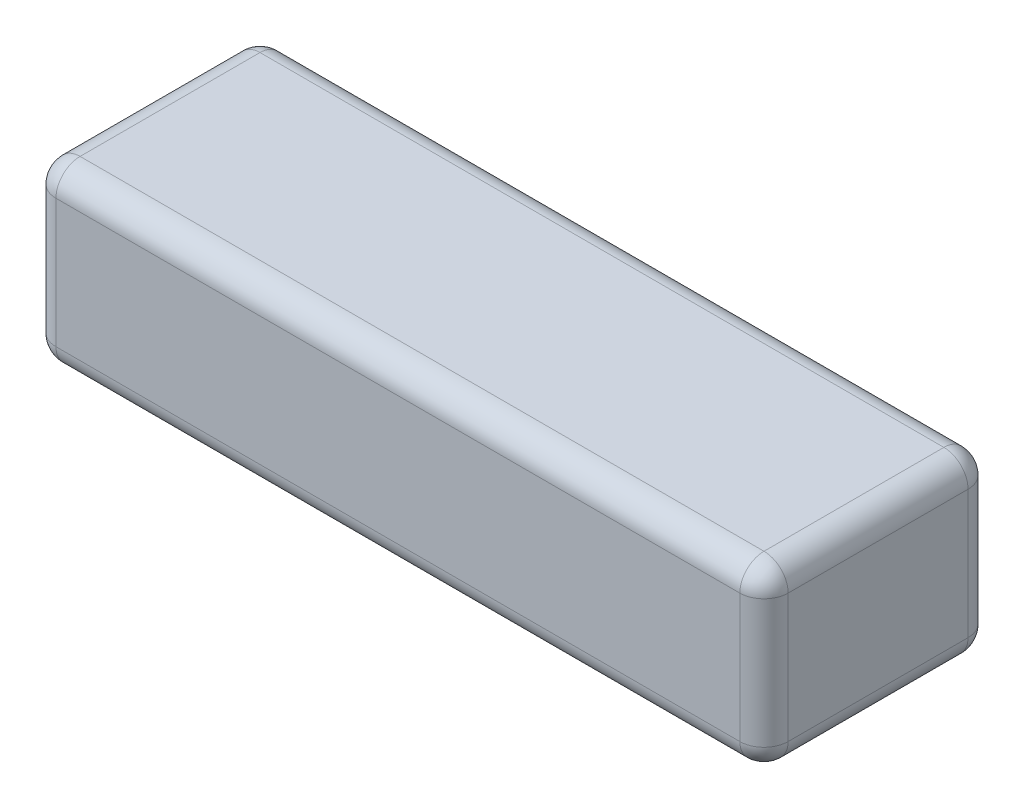
ISO-10303-21;
HEADER;
FILE_DESCRIPTION(('STEP AP214'),'2;1');
FILE_NAME('part.step','',(''),(''),'','','');
FILE_SCHEMA(('AUTOMOTIVE_DESIGN { 1 0 10303 214 1 1 1 1 }'));
ENDSEC;
DATA;
#1=APPLICATION_CONTEXT('core data for automotive mechanical design processes');
#2=APPLICATION_PROTOCOL_DEFINITION('international standard','automotive_design',2000,#1);
#3=PRODUCT_CONTEXT('',#1,'mechanical');
#4=PRODUCT('Part','Part','',(#3));
#5=PRODUCT_RELATED_PRODUCT_CATEGORY('part','',(#4));
#6=PRODUCT_DEFINITION_FORMATION('','',#4);
#7=PRODUCT_DEFINITION_CONTEXT('part definition',#1,'design');
#8=PRODUCT_DEFINITION('design','',#6,#7);
#9=PRODUCT_DEFINITION_SHAPE('','',#8);
#10=(LENGTH_UNIT() NAMED_UNIT(*) SI_UNIT(.MILLI.,.METRE.));
#11=(NAMED_UNIT(*) PLANE_ANGLE_UNIT() SI_UNIT($,.RADIAN.));
#12=(NAMED_UNIT(*) SI_UNIT($,.STERADIAN.) SOLID_ANGLE_UNIT());
#13=UNCERTAINTY_MEASURE_WITH_UNIT(LENGTH_MEASURE(1.E-05),#10,'distance_accuracy_value','');
#14=(GEOMETRIC_REPRESENTATION_CONTEXT(3) GLOBAL_UNCERTAINTY_ASSIGNED_CONTEXT((#13)) GLOBAL_UNIT_ASSIGNED_CONTEXT((#10,
#11,#12)) REPRESENTATION_CONTEXT('',''));
#15=CARTESIAN_POINT('',(0.,0.,0.));
#16=DIRECTION('',(0.,0.,1.));
#17=DIRECTION('',(1.,0.,0.));
#18=AXIS2_PLACEMENT_3D('',#15,#16,#17);
#19=CARTESIAN_POINT('',(77.,37.2,-24.));
#20=DIRECTION('',(-1.,0.,0.));
#21=DIRECTION('',(0.,0.,1.));
#22=AXIS2_PLACEMENT_3D('',#19,#20,#21);
#23=PLANE('',#22);
#24=DIRECTION('',(0.,-1.,0.));
#25=VECTOR('',#24,1.);
#26=CARTESIAN_POINT('',(77.,37.2,18.92));
#27=LINE('',#26,#25);
#28=CARTESIAN_POINT('',(77.,32.12,18.92));
#29=VERTEX_POINT('',#28);
#30=CARTESIAN_POINT('',(77.,5.08,18.92));
#31=VERTEX_POINT('',#30);
#32=EDGE_CURVE('E191',#29,#31,#27,.T.);
#33=ORIENTED_EDGE('',*,*,#32,.T.);
#34=DIRECTION('',(0.,0.,-1.));
#35=VECTOR('',#34,1.);
#36=CARTESIAN_POINT('',(77.,5.08,-24.));
#37=LINE('',#36,#35);
#38=CARTESIAN_POINT('',(77.,5.08,-18.92));
#39=VERTEX_POINT('',#38);
#40=EDGE_CURVE('E194',#31,#39,#37,.T.);
#41=ORIENTED_EDGE('',*,*,#40,.T.);
#42=DIRECTION('',(0.,-1.,0.));
#43=VECTOR('',#42,1.);
#44=CARTESIAN_POINT('',(77.,37.2,-18.92));
#45=LINE('',#44,#43);
#46=CARTESIAN_POINT('',(77.,32.12,-18.92));
#47=VERTEX_POINT('',#46);
#48=EDGE_CURVE('E189',#39,#47,#45,.F.);
#49=ORIENTED_EDGE('',*,*,#48,.T.);
#50=DIRECTION('',(0.,0.,-1.));
#51=VECTOR('',#50,1.);
#52=CARTESIAN_POINT('',(77.,32.12,24.));
#53=LINE('',#52,#51);
#54=EDGE_CURVE('E187',#47,#29,#53,.F.);
#55=ORIENTED_EDGE('',*,*,#54,.T.);
#56=EDGE_LOOP('',(#33,#41,#49,#55));
#57=FACE_BOUND('',#56,.T.);
#58=ADVANCED_FACE('F40',(#57),#23,.F.);
#59=CARTESIAN_POINT('',(-77.,37.2,-24.));
#60=DIRECTION('',(0.,0.,1.));
#61=DIRECTION('',(1.,0.,0.));
#62=AXIS2_PLACEMENT_3D('',#59,#60,#61);
#63=PLANE('',#62);
#64=DIRECTION('',(0.,-1.,0.));
#65=VECTOR('',#64,1.);
#66=CARTESIAN_POINT('',(71.92,37.2,-24.));
#67=LINE('',#66,#65);
#68=CARTESIAN_POINT('',(71.92,32.12,-24.));
#69=VERTEX_POINT('',#68);
#70=CARTESIAN_POINT('',(71.92,5.08,-24.));
#71=VERTEX_POINT('',#70);
#72=EDGE_CURVE('E173',#69,#71,#67,.T.);
#73=ORIENTED_EDGE('',*,*,#72,.T.);
#74=DIRECTION('',(-1.,0.,0.));
#75=VECTOR('',#74,1.);
#76=CARTESIAN_POINT('',(-77.,5.08,-24.));
#77=LINE('',#76,#75);
#78=CARTESIAN_POINT('',(-71.92,5.08,-24.));
#79=VERTEX_POINT('',#78);
#80=EDGE_CURVE('E178',#71,#79,#77,.T.);
#81=ORIENTED_EDGE('',*,*,#80,.T.);
#82=DIRECTION('',(0.,-1.,0.));
#83=VECTOR('',#82,1.);
#84=CARTESIAN_POINT('',(-71.92,37.2,-24.));
#85=LINE('',#84,#83);
#86=CARTESIAN_POINT('',(-71.92,32.12,-24.));
#87=VERTEX_POINT('',#86);
#88=EDGE_CURVE('E175',#79,#87,#85,.F.);
#89=ORIENTED_EDGE('',*,*,#88,.T.);
#90=DIRECTION('',(-1.,0.,0.));
#91=VECTOR('',#90,1.);
#92=CARTESIAN_POINT('',(77.,32.12,-24.));
#93=LINE('',#92,#91);
#94=EDGE_CURVE('E171',#87,#69,#93,.F.);
#95=ORIENTED_EDGE('',*,*,#94,.T.);
#96=EDGE_LOOP('',(#73,#81,#89,#95));
#97=FACE_BOUND('',#96,.T.);
#98=ADVANCED_FACE('F312',(#97),#63,.F.);
#99=CARTESIAN_POINT('',(-77.,37.2,-24.));
#100=DIRECTION('',(1.,0.,0.));
#101=DIRECTION('',(0.,0.,-1.));
#102=AXIS2_PLACEMENT_3D('',#99,#100,#101);
#103=PLANE('',#102);
#104=DIRECTION('',(0.,-1.,0.));
#105=VECTOR('',#104,1.);
#106=CARTESIAN_POINT('',(-77.,37.2,-18.92));
#107=LINE('',#106,#105);
#108=CARTESIAN_POINT('',(-77.,32.12,-18.92));
#109=VERTEX_POINT('',#108);
#110=CARTESIAN_POINT('',(-77.,5.08,-18.92));
#111=VERTEX_POINT('',#110);
#112=EDGE_CURVE('E139',#109,#111,#107,.T.);
#113=ORIENTED_EDGE('',*,*,#112,.T.);
#114=DIRECTION('',(0.,0.,1.));
#115=VECTOR('',#114,1.);
#116=CARTESIAN_POINT('',(-77.,5.08,-24.));
#117=LINE('',#116,#115);
#118=CARTESIAN_POINT('',(-77.,5.08,18.92));
#119=VERTEX_POINT('',#118);
#120=EDGE_CURVE('E135',#111,#119,#117,.T.);
#121=ORIENTED_EDGE('',*,*,#120,.T.);
#122=DIRECTION('',(0.,-1.,0.));
#123=VECTOR('',#122,1.);
#124=CARTESIAN_POINT('',(-77.,37.2,18.92));
#125=LINE('',#124,#123);
#126=CARTESIAN_POINT('',(-77.,32.12,18.92));
#127=VERTEX_POINT('',#126);
#128=EDGE_CURVE('E127',#119,#127,#125,.F.);
#129=ORIENTED_EDGE('',*,*,#128,.T.);
#130=DIRECTION('',(0.,0.,1.));
#131=VECTOR('',#130,1.);
#132=CARTESIAN_POINT('',(-77.,32.12,-24.));
#133=LINE('',#132,#131);
#134=EDGE_CURVE('E132',#127,#109,#133,.F.);
#135=ORIENTED_EDGE('',*,*,#134,.T.);
#136=EDGE_LOOP('',(#113,#121,#129,#135));
#137=FACE_BOUND('',#136,.T.);
#138=ADVANCED_FACE('F130',(#137),#103,.F.);
#139=CARTESIAN_POINT('',(-77.,37.2,24.));
#140=DIRECTION('',(0.,0.,-1.));
#141=DIRECTION('',(-1.,0.,0.));
#142=AXIS2_PLACEMENT_3D('',#139,#140,#141);
#143=PLANE('',#142);
#144=DIRECTION('',(0.,-1.,0.));
#145=VECTOR('',#144,1.);
#146=CARTESIAN_POINT('',(-71.92,37.2,24.));
#147=LINE('',#146,#145);
#148=CARTESIAN_POINT('',(-71.92,32.12,24.));
#149=VERTEX_POINT('',#148);
#150=CARTESIAN_POINT('',(-71.92,5.08,24.));
#151=VERTEX_POINT('',#150);
#152=EDGE_CURVE('E147',#149,#151,#147,.T.);
#153=ORIENTED_EDGE('',*,*,#152,.T.);
#154=DIRECTION('',(1.,0.,0.));
#155=VECTOR('',#154,1.);
#156=CARTESIAN_POINT('',(-77.,5.08,24.));
#157=LINE('',#156,#155);
#158=CARTESIAN_POINT('',(71.92,5.08,24.));
#159=VERTEX_POINT('',#158);
#160=EDGE_CURVE('E185',#151,#159,#157,.T.);
#161=ORIENTED_EDGE('',*,*,#160,.T.);
#162=DIRECTION('',(0.,-1.,0.));
#163=VECTOR('',#162,1.);
#164=CARTESIAN_POINT('',(71.92,37.2,24.));
#165=LINE('',#164,#163);
#166=CARTESIAN_POINT('',(71.92,32.12,24.));
#167=VERTEX_POINT('',#166);
#168=EDGE_CURVE('E182',#159,#167,#165,.F.);
#169=ORIENTED_EDGE('',*,*,#168,.T.);
#170=DIRECTION('',(1.,0.,0.));
#171=VECTOR('',#170,1.);
#172=CARTESIAN_POINT('',(-77.,32.12,24.));
#173=LINE('',#172,#171);
#174=EDGE_CURVE('E180',#167,#149,#173,.F.);
#175=ORIENTED_EDGE('',*,*,#174,.T.);
#176=EDGE_LOOP('',(#153,#161,#169,#175));
#177=FACE_BOUND('',#176,.T.);
#178=ADVANCED_FACE('F303',(#177),#143,.F.);
#179=CARTESIAN_POINT('',(0.,37.2,0.));
#180=DIRECTION('',(0.,1.,0.));
#181=DIRECTION('',(0.,0.,1.));
#182=AXIS2_PLACEMENT_3D('',#179,#180,#181);
#183=PLANE('',#182);
#184=DIRECTION('',(0.,0.,1.));
#185=VECTOR('',#184,1.);
#186=CARTESIAN_POINT('',(-71.92,37.2,24.));
#187=LINE('',#186,#185);
#188=CARTESIAN_POINT('',(-71.92,37.2,-18.92));
#189=VERTEX_POINT('',#188);
#190=CARTESIAN_POINT('',(-71.92,37.2,18.92));
#191=VERTEX_POINT('',#190);
#192=EDGE_CURVE('E49',#189,#191,#187,.T.);
#193=ORIENTED_EDGE('',*,*,#192,.T.);
#194=DIRECTION('',(1.,0.,0.));
#195=VECTOR('',#194,1.);
#196=CARTESIAN_POINT('',(77.,37.2,18.92));
#197=LINE('',#196,#195);
#198=CARTESIAN_POINT('',(71.92,37.2,18.92));
#199=VERTEX_POINT('',#198);
#200=EDGE_CURVE('E11',#191,#199,#197,.T.);
#201=ORIENTED_EDGE('',*,*,#200,.T.);
#202=DIRECTION('',(0.,0.,-1.));
#203=VECTOR('',#202,1.);
#204=CARTESIAN_POINT('',(71.92,37.2,-24.));
#205=LINE('',#204,#203);
#206=CARTESIAN_POINT('',(71.92,37.2,-18.92));
#207=VERTEX_POINT('',#206);
#208=EDGE_CURVE('E205',#199,#207,#205,.T.);
#209=ORIENTED_EDGE('',*,*,#208,.T.);
#210=DIRECTION('',(-1.,0.,0.));
#211=VECTOR('',#210,1.);
#212=CARTESIAN_POINT('',(-77.,37.2,-18.92));
#213=LINE('',#212,#211);
#214=EDGE_CURVE('E60',#207,#189,#213,.T.);
#215=ORIENTED_EDGE('',*,*,#214,.T.);
#216=EDGE_LOOP('',(#193,#201,#209,#215));
#217=FACE_BOUND('',#216,.T.);
#218=ADVANCED_FACE('F305',(#217),#183,.T.);
#219=CARTESIAN_POINT('',(0.,0.,0.));
#220=DIRECTION('',(0.,1.,0.));
#221=DIRECTION('',(0.,0.,1.));
#222=AXIS2_PLACEMENT_3D('',#219,#220,#221);
#223=PLANE('',#222);
#224=DIRECTION('',(0.,0.,1.));
#225=VECTOR('',#224,1.);
#226=CARTESIAN_POINT('',(-71.92,0.,0.));
#227=LINE('',#226,#225);
#228=CARTESIAN_POINT('',(-71.92,0.,18.92));
#229=VERTEX_POINT('',#228);
#230=CARTESIAN_POINT('',(-71.92,0.,-18.92));
#231=VERTEX_POINT('',#230);
#232=EDGE_CURVE('E200',#229,#231,#227,.F.);
#233=ORIENTED_EDGE('',*,*,#232,.T.);
#234=DIRECTION('',(-1.,0.,0.));
#235=VECTOR('',#234,1.);
#236=CARTESIAN_POINT('',(0.,0.,-18.92));
#237=LINE('',#236,#235);
#238=CARTESIAN_POINT('',(71.92,0.,-18.92));
#239=VERTEX_POINT('',#238);
#240=EDGE_CURVE('E202',#231,#239,#237,.F.);
#241=ORIENTED_EDGE('',*,*,#240,.T.);
#242=DIRECTION('',(0.,0.,-1.));
#243=VECTOR('',#242,1.);
#244=CARTESIAN_POINT('',(71.92,0.,0.));
#245=LINE('',#244,#243);
#246=CARTESIAN_POINT('',(71.92,0.,18.92));
#247=VERTEX_POINT('',#246);
#248=EDGE_CURVE('E196',#239,#247,#245,.F.);
#249=ORIENTED_EDGE('',*,*,#248,.T.);
#250=DIRECTION('',(1.,0.,0.));
#251=VECTOR('',#250,1.);
#252=CARTESIAN_POINT('',(0.,0.,18.92));
#253=LINE('',#252,#251);
#254=EDGE_CURVE('E198',#247,#229,#253,.F.);
#255=ORIENTED_EDGE('',*,*,#254,.T.);
#256=EDGE_LOOP('',(#233,#241,#249,#255));
#257=FACE_BOUND('',#256,.T.);
#258=ADVANCED_FACE('F272',(#257),#223,.F.);
#259=CARTESIAN_POINT('',(71.92,37.2,18.92));
#260=DIRECTION('',(0.,-1.,0.));
#261=DIRECTION('',(0.,0.,-1.));
#262=AXIS2_PLACEMENT_3D('',#259,#260,#261);
#263=CYLINDRICAL_SURFACE('',#262,5.08);
#264=CARTESIAN_POINT('',(71.92,32.12,18.92));
#265=DIRECTION('',(0.,1.,0.));
#266=DIRECTION('',(0.,0.,1.));
#267=AXIS2_PLACEMENT_3D('',#264,#265,#266);
#268=CIRCLE('',#267,5.08);
#269=EDGE_CURVE('E44',#167,#29,#268,.T.);
#270=ORIENTED_EDGE('',*,*,#269,.F.);
#271=ORIENTED_EDGE('',*,*,#168,.F.);
#272=CARTESIAN_POINT('',(71.92,5.08,18.92));
#273=DIRECTION('',(0.,-1.,0.));
#274=DIRECTION('',(0.,0.,-1.));
#275=AXIS2_PLACEMENT_3D('',#272,#273,#274);
#276=CIRCLE('',#275,5.08);
#277=EDGE_CURVE('E167',#31,#159,#276,.T.);
#278=ORIENTED_EDGE('',*,*,#277,.F.);
#279=ORIENTED_EDGE('',*,*,#32,.F.);
#280=EDGE_LOOP('',(#270,#271,#278,#279));
#281=FACE_BOUND('',#280,.T.);
#282=ADVANCED_FACE('F42',(#281),#263,.T.);
#283=CARTESIAN_POINT('',(71.92,32.12,18.92));
#284=DIRECTION('',(1.,0.,0.));
#285=DIRECTION('',(0.,0.,-1.));
#286=AXIS2_PLACEMENT_3D('',#283,#284,#285);
#287=SPHERICAL_SURFACE('',#286,5.08);
#288=CARTESIAN_POINT('',(71.92,32.12,18.92));
#289=DIRECTION('',(1.,0.,0.));
#290=DIRECTION('',(0.,0.,-1.));
#291=AXIS2_PLACEMENT_3D('',#288,#289,#290);
#292=CIRCLE('',#291,5.08);
#293=EDGE_CURVE('E251',#167,#199,#292,.F.);
#294=ORIENTED_EDGE('',*,*,#293,.F.);
#295=ORIENTED_EDGE('',*,*,#269,.T.);
#296=CARTESIAN_POINT('',(71.92,32.12,18.92));
#297=DIRECTION('',(0.,0.,1.));
#298=DIRECTION('',(1.,0.,0.));
#299=AXIS2_PLACEMENT_3D('',#296,#297,#298);
#300=CIRCLE('',#299,5.08);
#301=EDGE_CURVE('E254',#199,#29,#300,.F.);
#302=ORIENTED_EDGE('',*,*,#301,.F.);
#303=EDGE_LOOP('',(#294,#295,#302));
#304=FACE_BOUND('',#303,.T.);
#305=ADVANCED_FACE('F298',(#304),#287,.T.);
#306=CARTESIAN_POINT('',(71.92,5.08,18.92));
#307=DIRECTION('',(0.,0.,1.));
#308=DIRECTION('',(0.,-1.,0.));
#309=AXIS2_PLACEMENT_3D('',#306,#307,#308);
#310=SPHERICAL_SURFACE('',#309,5.08);
#311=CARTESIAN_POINT('',(71.92,5.08,18.92));
#312=DIRECTION('',(0.,0.,1.));
#313=DIRECTION('',(1.,0.,0.));
#314=AXIS2_PLACEMENT_3D('',#311,#312,#313);
#315=CIRCLE('',#314,5.08);
#316=EDGE_CURVE('E245',#31,#247,#315,.F.);
#317=ORIENTED_EDGE('',*,*,#316,.F.);
#318=ORIENTED_EDGE('',*,*,#277,.T.);
#319=CARTESIAN_POINT('',(71.92,5.08,18.92));
#320=DIRECTION('',(1.,0.,0.));
#321=DIRECTION('',(0.,0.,-1.));
#322=AXIS2_PLACEMENT_3D('',#319,#320,#321);
#323=CIRCLE('',#322,5.08);
#324=EDGE_CURVE('E248',#247,#159,#323,.F.);
#325=ORIENTED_EDGE('',*,*,#324,.F.);
#326=EDGE_LOOP('',(#317,#318,#325));
#327=FACE_BOUND('',#326,.T.);
#328=ADVANCED_FACE('F261',(#327),#310,.T.);
#329=CARTESIAN_POINT('',(71.92,32.12,0.));
#330=DIRECTION('',(0.,0.,1.));
#331=DIRECTION('',(1.,0.,0.));
#332=AXIS2_PLACEMENT_3D('',#329,#330,#331);
#333=CYLINDRICAL_SURFACE('',#332,5.08);
#334=ORIENTED_EDGE('',*,*,#301,.T.);
#335=ORIENTED_EDGE('',*,*,#54,.F.);
#336=CARTESIAN_POINT('',(71.92,32.12,-18.92));
#337=DIRECTION('',(0.,0.,-1.));
#338=DIRECTION('',(-1.,0.,0.));
#339=AXIS2_PLACEMENT_3D('',#336,#337,#338);
#340=CIRCLE('',#339,5.08);
#341=EDGE_CURVE('E239',#207,#47,#340,.T.);
#342=ORIENTED_EDGE('',*,*,#341,.F.);
#343=ORIENTED_EDGE('',*,*,#208,.F.);
#344=EDGE_LOOP('',(#334,#335,#342,#343));
#345=FACE_BOUND('',#344,.T.);
#346=ADVANCED_FACE('F293',(#345),#333,.T.);
#347=CARTESIAN_POINT('',(0.,32.12,18.92));
#348=DIRECTION('',(-1.,0.,0.));
#349=DIRECTION('',(0.,0.,1.));
#350=AXIS2_PLACEMENT_3D('',#347,#348,#349);
#351=CYLINDRICAL_SURFACE('',#350,5.08);
#352=ORIENTED_EDGE('',*,*,#293,.T.);
#353=ORIENTED_EDGE('',*,*,#200,.F.);
#354=CARTESIAN_POINT('',(-71.92,32.12,18.92));
#355=DIRECTION('',(-1.,0.,0.));
#356=DIRECTION('',(0.,0.,1.));
#357=AXIS2_PLACEMENT_3D('',#354,#355,#356);
#358=CIRCLE('',#357,5.08);
#359=EDGE_CURVE('E151',#149,#191,#358,.T.);
#360=ORIENTED_EDGE('',*,*,#359,.F.);
#361=ORIENTED_EDGE('',*,*,#174,.F.);
#362=EDGE_LOOP('',(#352,#353,#360,#361));
#363=FACE_BOUND('',#362,.T.);
#364=ADVANCED_FACE('F301',(#363),#351,.T.);
#365=CARTESIAN_POINT('',(-71.92,37.2,18.92));
#366=DIRECTION('',(0.,-1.,0.));
#367=DIRECTION('',(0.,0.,-1.));
#368=AXIS2_PLACEMENT_3D('',#365,#366,#367);
#369=CYLINDRICAL_SURFACE('',#368,5.08);
#370=CARTESIAN_POINT('',(-71.92,5.08,18.92));
#371=DIRECTION('',(0.,-1.,0.));
#372=DIRECTION('',(0.,0.,-1.));
#373=AXIS2_PLACEMENT_3D('',#370,#371,#372);
#374=CIRCLE('',#373,5.08);
#375=EDGE_CURVE('E152',#151,#119,#374,.T.);
#376=ORIENTED_EDGE('',*,*,#375,.F.);
#377=ORIENTED_EDGE('',*,*,#152,.F.);
#378=CARTESIAN_POINT('',(-71.92,32.12,18.92));
#379=DIRECTION('',(0.,1.,0.));
#380=DIRECTION('',(0.,0.,1.));
#381=AXIS2_PLACEMENT_3D('',#378,#379,#380);
#382=CIRCLE('',#381,5.08);
#383=EDGE_CURVE('E143',#127,#149,#382,.T.);
#384=ORIENTED_EDGE('',*,*,#383,.F.);
#385=ORIENTED_EDGE('',*,*,#128,.F.);
#386=EDGE_LOOP('',(#376,#377,#384,#385));
#387=FACE_BOUND('',#386,.T.);
#388=ADVANCED_FACE('F145',(#387),#369,.T.);
#389=CARTESIAN_POINT('',(-77.,5.08,18.92));
#390=DIRECTION('',(1.,0.,0.));
#391=DIRECTION('',(0.,0.,-1.));
#392=AXIS2_PLACEMENT_3D('',#389,#390,#391);
#393=CYLINDRICAL_SURFACE('',#392,5.08);
#394=ORIENTED_EDGE('',*,*,#324,.T.);
#395=ORIENTED_EDGE('',*,*,#160,.F.);
#396=CARTESIAN_POINT('',(-71.92,5.08,18.92));
#397=DIRECTION('',(-1.,0.,0.));
#398=DIRECTION('',(0.,0.,1.));
#399=AXIS2_PLACEMENT_3D('',#396,#397,#398);
#400=CIRCLE('',#399,5.08);
#401=EDGE_CURVE('E235',#229,#151,#400,.T.);
#402=ORIENTED_EDGE('',*,*,#401,.F.);
#403=ORIENTED_EDGE('',*,*,#254,.F.);
#404=EDGE_LOOP('',(#394,#395,#402,#403));
#405=FACE_BOUND('',#404,.T.);
#406=ADVANCED_FACE('F268',(#405),#393,.T.);
#407=CARTESIAN_POINT('',(71.92,5.08,-24.));
#408=DIRECTION('',(0.,0.,-1.));
#409=DIRECTION('',(-1.,0.,0.));
#410=AXIS2_PLACEMENT_3D('',#407,#408,#409);
#411=CYLINDRICAL_SURFACE('',#410,5.08);
#412=ORIENTED_EDGE('',*,*,#316,.T.);
#413=ORIENTED_EDGE('',*,*,#248,.F.);
#414=CARTESIAN_POINT('',(71.92,5.08,-18.92));
#415=DIRECTION('',(0.,0.,-1.));
#416=DIRECTION('',(-1.,0.,0.));
#417=AXIS2_PLACEMENT_3D('',#414,#415,#416);
#418=CIRCLE('',#417,5.08);
#419=EDGE_CURVE('E232',#39,#239,#418,.T.);
#420=ORIENTED_EDGE('',*,*,#419,.F.);
#421=ORIENTED_EDGE('',*,*,#40,.F.);
#422=EDGE_LOOP('',(#412,#413,#420,#421));
#423=FACE_BOUND('',#422,.T.);
#424=ADVANCED_FACE('F278',(#423),#411,.T.);
#425=CARTESIAN_POINT('',(71.92,37.2,-18.92));
#426=DIRECTION('',(0.,-1.,0.));
#427=DIRECTION('',(0.,0.,-1.));
#428=AXIS2_PLACEMENT_3D('',#425,#426,#427);
#429=CYLINDRICAL_SURFACE('',#428,5.08);
#430=CARTESIAN_POINT('',(71.92,32.12,-18.92));
#431=DIRECTION('',(0.,1.,0.));
#432=DIRECTION('',(0.,0.,1.));
#433=AXIS2_PLACEMENT_3D('',#430,#431,#432);
#434=CIRCLE('',#433,5.08);
#435=EDGE_CURVE('E242',#47,#69,#434,.T.);
#436=ORIENTED_EDGE('',*,*,#435,.F.);
#437=ORIENTED_EDGE('',*,*,#48,.F.);
#438=CARTESIAN_POINT('',(71.92,5.08,-18.92));
#439=DIRECTION('',(0.,-1.,0.));
#440=DIRECTION('',(0.,0.,-1.));
#441=AXIS2_PLACEMENT_3D('',#438,#439,#440);
#442=CIRCLE('',#441,5.08);
#443=EDGE_CURVE('E229',#71,#39,#442,.T.);
#444=ORIENTED_EDGE('',*,*,#443,.F.);
#445=ORIENTED_EDGE('',*,*,#72,.F.);
#446=EDGE_LOOP('',(#436,#437,#444,#445));
#447=FACE_BOUND('',#446,.T.);
#448=ADVANCED_FACE('F285',(#447),#429,.T.);
#449=CARTESIAN_POINT('',(71.92,32.12,-18.92));
#450=DIRECTION('',(1.,0.,0.));
#451=DIRECTION('',(0.,0.,-1.));
#452=AXIS2_PLACEMENT_3D('',#449,#450,#451);
#453=SPHERICAL_SURFACE('',#452,5.08);
#454=ORIENTED_EDGE('',*,*,#341,.T.);
#455=ORIENTED_EDGE('',*,*,#435,.T.);
#456=CARTESIAN_POINT('',(71.92,32.12,-18.92));
#457=DIRECTION('',(1.,0.,0.));
#458=DIRECTION('',(0.,0.,-1.));
#459=AXIS2_PLACEMENT_3D('',#456,#457,#458);
#460=CIRCLE('',#459,5.08);
#461=EDGE_CURVE('E158',#207,#69,#460,.F.);
#462=ORIENTED_EDGE('',*,*,#461,.F.);
#463=EDGE_LOOP('',(#454,#455,#462));
#464=FACE_BOUND('',#463,.T.);
#465=ADVANCED_FACE('F291',(#464),#453,.T.);
#466=CARTESIAN_POINT('',(-71.92,32.12,18.92));
#467=DIRECTION('',(0.,0.,1.));
#468=DIRECTION('',(1.,0.,0.));
#469=AXIS2_PLACEMENT_3D('',#466,#467,#468);
#470=SPHERICAL_SURFACE('',#469,5.08);
#471=ORIENTED_EDGE('',*,*,#383,.T.);
#472=ORIENTED_EDGE('',*,*,#359,.T.);
#473=CARTESIAN_POINT('',(-71.92,32.12,18.92));
#474=DIRECTION('',(0.,0.,1.));
#475=DIRECTION('',(1.,0.,0.));
#476=AXIS2_PLACEMENT_3D('',#473,#474,#475);
#477=CIRCLE('',#476,5.08);
#478=EDGE_CURVE('E155',#127,#191,#477,.F.);
#479=ORIENTED_EDGE('',*,*,#478,.F.);
#480=EDGE_LOOP('',(#471,#472,#479));
#481=FACE_BOUND('',#480,.T.);
#482=ADVANCED_FACE('F156',(#481),#470,.T.);
#483=CARTESIAN_POINT('',(-71.92,5.08,18.92));
#484=DIRECTION('',(0.,0.,1.));
#485=DIRECTION('',(0.,-1.,0.));
#486=AXIS2_PLACEMENT_3D('',#483,#484,#485);
#487=SPHERICAL_SURFACE('',#486,5.08);
#488=ORIENTED_EDGE('',*,*,#401,.T.);
#489=ORIENTED_EDGE('',*,*,#375,.T.);
#490=CARTESIAN_POINT('',(-71.92,5.08,18.92));
#491=DIRECTION('',(0.,0.,1.));
#492=DIRECTION('',(1.,0.,0.));
#493=AXIS2_PLACEMENT_3D('',#490,#491,#492);
#494=CIRCLE('',#493,5.08);
#495=EDGE_CURVE('E159',#229,#119,#494,.F.);
#496=ORIENTED_EDGE('',*,*,#495,.F.);
#497=EDGE_LOOP('',(#488,#489,#496));
#498=FACE_BOUND('',#497,.T.);
#499=ADVANCED_FACE('F352',(#498),#487,.T.);
#500=CARTESIAN_POINT('',(71.92,5.08,-18.92));
#501=DIRECTION('',(1.,0.,0.));
#502=DIRECTION('',(0.,1.,0.));
#503=AXIS2_PLACEMENT_3D('',#500,#501,#502);
#504=SPHERICAL_SURFACE('',#503,5.08);
#505=ORIENTED_EDGE('',*,*,#443,.T.);
#506=ORIENTED_EDGE('',*,*,#419,.T.);
#507=CARTESIAN_POINT('',(71.92,5.08,-18.92));
#508=DIRECTION('',(1.,0.,0.));
#509=DIRECTION('',(0.,0.,-1.));
#510=AXIS2_PLACEMENT_3D('',#507,#508,#509);
#511=CIRCLE('',#510,5.08);
#512=EDGE_CURVE('E223',#71,#239,#511,.F.);
#513=ORIENTED_EDGE('',*,*,#512,.F.);
#514=EDGE_LOOP('',(#505,#506,#513));
#515=FACE_BOUND('',#514,.T.);
#516=ADVANCED_FACE('F348',(#515),#504,.T.);
#517=CARTESIAN_POINT('',(0.,32.12,-18.92));
#518=DIRECTION('',(1.,0.,0.));
#519=DIRECTION('',(0.,0.,-1.));
#520=AXIS2_PLACEMENT_3D('',#517,#518,#519);
#521=CYLINDRICAL_SURFACE('',#520,5.08);
#522=ORIENTED_EDGE('',*,*,#461,.T.);
#523=ORIENTED_EDGE('',*,*,#94,.F.);
#524=CARTESIAN_POINT('',(-71.92,32.12,-18.92));
#525=DIRECTION('',(-1.,0.,0.));
#526=DIRECTION('',(0.,0.,1.));
#527=AXIS2_PLACEMENT_3D('',#524,#525,#526);
#528=CIRCLE('',#527,5.08);
#529=EDGE_CURVE('E220',#189,#87,#528,.T.);
#530=ORIENTED_EDGE('',*,*,#529,.F.);
#531=ORIENTED_EDGE('',*,*,#214,.F.);
#532=EDGE_LOOP('',(#522,#523,#530,#531));
#533=FACE_BOUND('',#532,.T.);
#534=ADVANCED_FACE('F345',(#533),#521,.T.);
#535=CARTESIAN_POINT('',(-71.92,32.12,0.));
#536=DIRECTION('',(0.,0.,-1.));
#537=DIRECTION('',(-1.,0.,0.));
#538=AXIS2_PLACEMENT_3D('',#535,#536,#537);
#539=CYLINDRICAL_SURFACE('',#538,5.08);
#540=ORIENTED_EDGE('',*,*,#478,.T.);
#541=ORIENTED_EDGE('',*,*,#192,.F.);
#542=CARTESIAN_POINT('',(-71.92,32.12,-18.92));
#543=DIRECTION('',(0.,0.,-1.));
#544=DIRECTION('',(-1.,0.,0.));
#545=AXIS2_PLACEMENT_3D('',#542,#543,#544);
#546=CIRCLE('',#545,5.08);
#547=EDGE_CURVE('E163',#109,#189,#546,.T.);
#548=ORIENTED_EDGE('',*,*,#547,.F.);
#549=ORIENTED_EDGE('',*,*,#134,.F.);
#550=EDGE_LOOP('',(#540,#541,#548,#549));
#551=FACE_BOUND('',#550,.T.);
#552=ADVANCED_FACE('F161',(#551),#539,.T.);
#553=CARTESIAN_POINT('',(-71.92,5.08,-24.));
#554=DIRECTION('',(0.,0.,1.));
#555=DIRECTION('',(1.,0.,0.));
#556=AXIS2_PLACEMENT_3D('',#553,#554,#555);
#557=CYLINDRICAL_SURFACE('',#556,5.08);
#558=ORIENTED_EDGE('',*,*,#495,.T.);
#559=ORIENTED_EDGE('',*,*,#120,.F.);
#560=CARTESIAN_POINT('',(-71.92,5.08,-18.92));
#561=DIRECTION('',(0.,0.,-1.));
#562=DIRECTION('',(-1.,0.,0.));
#563=AXIS2_PLACEMENT_3D('',#560,#561,#562);
#564=CIRCLE('',#563,5.08);
#565=EDGE_CURVE('E216',#231,#111,#564,.T.);
#566=ORIENTED_EDGE('',*,*,#565,.F.);
#567=ORIENTED_EDGE('',*,*,#232,.F.);
#568=EDGE_LOOP('',(#558,#559,#566,#567));
#569=FACE_BOUND('',#568,.T.);
#570=ADVANCED_FACE('F338',(#569),#557,.T.);
#571=CARTESIAN_POINT('',(-77.,5.08,-18.92));
#572=DIRECTION('',(-1.,0.,0.));
#573=DIRECTION('',(0.,0.,1.));
#574=AXIS2_PLACEMENT_3D('',#571,#572,#573);
#575=CYLINDRICAL_SURFACE('',#574,5.08);
#576=ORIENTED_EDGE('',*,*,#512,.T.);
#577=ORIENTED_EDGE('',*,*,#240,.F.);
#578=CARTESIAN_POINT('',(-71.92,5.08,-18.92));
#579=DIRECTION('',(-1.,0.,0.));
#580=DIRECTION('',(0.,0.,1.));
#581=AXIS2_PLACEMENT_3D('',#578,#579,#580);
#582=CIRCLE('',#581,5.08);
#583=EDGE_CURVE('E213',#79,#231,#582,.T.);
#584=ORIENTED_EDGE('',*,*,#583,.F.);
#585=ORIENTED_EDGE('',*,*,#80,.F.);
#586=EDGE_LOOP('',(#576,#577,#584,#585));
#587=FACE_BOUND('',#586,.T.);
#588=ADVANCED_FACE('F334',(#587),#575,.T.);
#589=CARTESIAN_POINT('',(-71.92,32.12,-18.92));
#590=DIRECTION('',(0.,1.,0.));
#591=DIRECTION('',(0.,0.,1.));
#592=AXIS2_PLACEMENT_3D('',#589,#590,#591);
#593=SPHERICAL_SURFACE('',#592,5.08);
#594=ORIENTED_EDGE('',*,*,#547,.T.);
#595=ORIENTED_EDGE('',*,*,#529,.T.);
#596=CARTESIAN_POINT('',(-71.92,32.12,-18.92));
#597=DIRECTION('',(0.,1.,0.));
#598=DIRECTION('',(0.,0.,1.));
#599=AXIS2_PLACEMENT_3D('',#596,#597,#598);
#600=CIRCLE('',#599,5.08);
#601=EDGE_CURVE('E211',#109,#87,#600,.F.);
#602=ORIENTED_EDGE('',*,*,#601,.F.);
#603=EDGE_LOOP('',(#594,#595,#602));
#604=FACE_BOUND('',#603,.T.);
#605=ADVANCED_FACE('F330',(#604),#593,.T.);
#606=CARTESIAN_POINT('',(-71.92,5.08,-18.92));
#607=DIRECTION('',(0.,-1.,0.));
#608=DIRECTION('',(0.,0.,-1.));
#609=AXIS2_PLACEMENT_3D('',#606,#607,#608);
#610=SPHERICAL_SURFACE('',#609,5.08);
#611=ORIENTED_EDGE('',*,*,#583,.T.);
#612=ORIENTED_EDGE('',*,*,#565,.T.);
#613=CARTESIAN_POINT('',(-71.92,5.08,-18.92));
#614=DIRECTION('',(0.,-1.,0.));
#615=DIRECTION('',(0.,0.,-1.));
#616=AXIS2_PLACEMENT_3D('',#613,#614,#615);
#617=CIRCLE('',#616,5.08);
#618=EDGE_CURVE('E209',#79,#111,#617,.F.);
#619=ORIENTED_EDGE('',*,*,#618,.F.);
#620=EDGE_LOOP('',(#611,#612,#619));
#621=FACE_BOUND('',#620,.T.);
#622=ADVANCED_FACE('F326',(#621),#610,.T.);
#623=CARTESIAN_POINT('',(-71.92,37.2,-18.92));
#624=DIRECTION('',(0.,-1.,0.));
#625=DIRECTION('',(0.,0.,-1.));
#626=AXIS2_PLACEMENT_3D('',#623,#624,#625);
#627=CYLINDRICAL_SURFACE('',#626,5.08);
#628=ORIENTED_EDGE('',*,*,#601,.T.);
#629=ORIENTED_EDGE('',*,*,#88,.F.);
#630=ORIENTED_EDGE('',*,*,#618,.T.);
#631=ORIENTED_EDGE('',*,*,#112,.F.);
#632=EDGE_LOOP('',(#628,#629,#630,#631));
#633=FACE_BOUND('',#632,.T.);
#634=ADVANCED_FACE('F323',(#633),#627,.T.);
#635=CLOSED_SHELL('',(#58,#98,#138,#178,#218,#258,#282,#305,#328,#346,#364,#388,#406,#424,#448,
#465,#482,#499,#516,#534,#552,#570,#588,#605,#622,#634));
#636=MANIFOLD_SOLID_BREP('B2',#635);
#637=ADVANCED_BREP_SHAPE_REPRESENTATION('',(#18,#636),#14);
#638=SHAPE_DEFINITION_REPRESENTATION(#9,#637);
ENDSEC;
END-ISO-10303-21;
